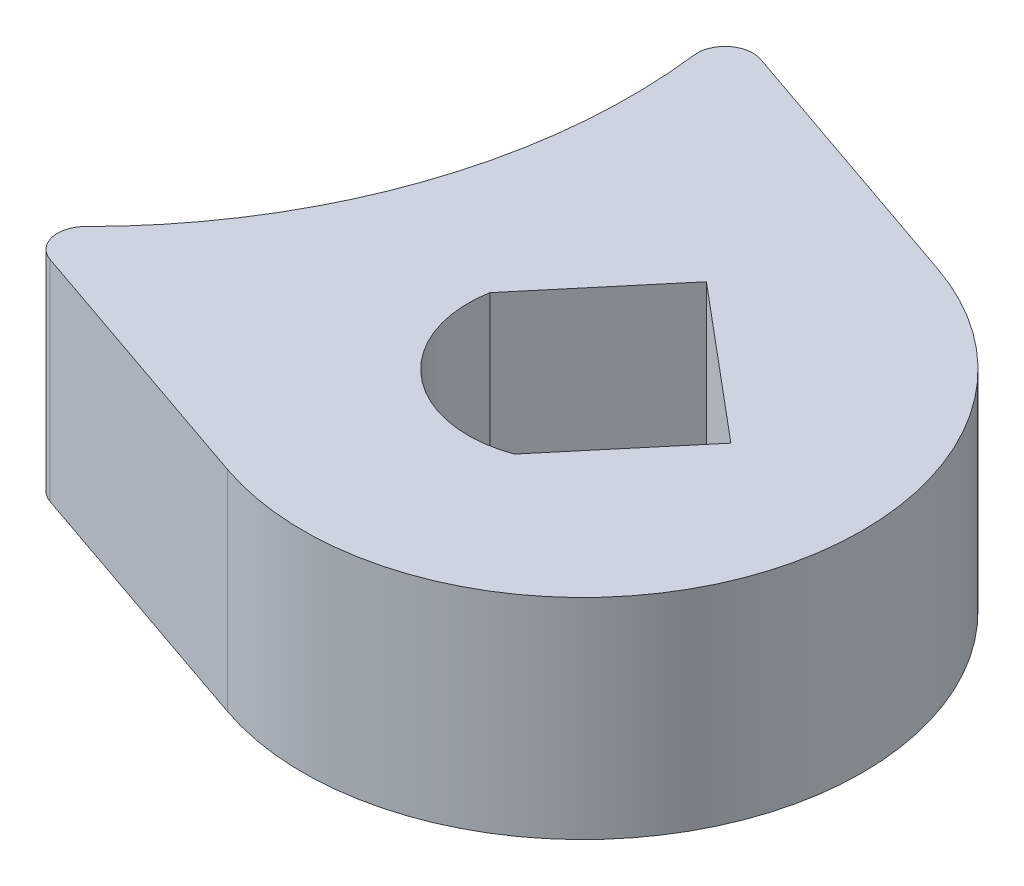
ISO-10303-21;
HEADER;
FILE_DESCRIPTION(('STEP AP214'),'2;1');
FILE_NAME('part.step','',(''),(''),'','','');
FILE_SCHEMA(('AUTOMOTIVE_DESIGN { 1 0 10303 214 1 1 1 1 }'));
ENDSEC;
DATA;
#1=APPLICATION_CONTEXT('core data for automotive mechanical design processes');
#2=APPLICATION_PROTOCOL_DEFINITION('international standard','automotive_design',2000,#1);
#3=PRODUCT_CONTEXT('',#1,'mechanical');
#4=PRODUCT('Part','Part','',(#3));
#5=PRODUCT_RELATED_PRODUCT_CATEGORY('part','',(#4));
#6=PRODUCT_DEFINITION_FORMATION('','',#4);
#7=PRODUCT_DEFINITION_CONTEXT('part definition',#1,'design');
#8=PRODUCT_DEFINITION('design','',#6,#7);
#9=PRODUCT_DEFINITION_SHAPE('','',#8);
#10=(LENGTH_UNIT() NAMED_UNIT(*) SI_UNIT(.MILLI.,.METRE.));
#11=(NAMED_UNIT(*) PLANE_ANGLE_UNIT() SI_UNIT($,.RADIAN.));
#12=(NAMED_UNIT(*) SI_UNIT($,.STERADIAN.) SOLID_ANGLE_UNIT());
#13=UNCERTAINTY_MEASURE_WITH_UNIT(LENGTH_MEASURE(1.E-05),#10,'distance_accuracy_value','');
#14=(GEOMETRIC_REPRESENTATION_CONTEXT(3) GLOBAL_UNCERTAINTY_ASSIGNED_CONTEXT((#13)) GLOBAL_UNIT_ASSIGNED_CONTEXT((#10,
#11,#12)) REPRESENTATION_CONTEXT('',''));
#15=CARTESIAN_POINT('',(0.,0.,0.));
#16=DIRECTION('',(0.,0.,1.));
#17=DIRECTION('',(1.,0.,0.));
#18=AXIS2_PLACEMENT_3D('',#15,#16,#17);
#19=CARTESIAN_POINT('',(0.,19.05,0.));
#20=DIRECTION('',(0.,1.,0.));
#21=DIRECTION('',(0.,0.,1.));
#22=AXIS2_PLACEMENT_3D('',#19,#20,#21);
#23=PLANE('',#22);
#24=CARTESIAN_POINT('',(-68.791514605057,19.05,-23.6828592581137));
#25=DIRECTION('',(0.,-1.,0.));
#26=DIRECTION('',(0.,0.,-1.));
#27=AXIS2_PLACEMENT_3D('',#24,#25,#26);
#28=CIRCLE('',#27,49.5);
#29=CARTESIAN_POINT('',(-19.6669026936804,19.05,-29.767471370371));
#30=VERTEX_POINT('',#29);
#31=CARTESIAN_POINT('',(-33.8232481986751,19.05,11.352413604136));
#32=VERTEX_POINT('',#31);
#33=EDGE_CURVE('E159',#30,#32,#28,.T.);
#34=ORIENTED_EDGE('',*,*,#33,.T.);
#35=CARTESIAN_POINT('',(-32.0289169527718,19.05,13.1501831611081));
#36=DIRECTION('',(0.,1.,0.));
#37=DIRECTION('',(0.,0.,1.));
#38=AXIS2_PLACEMENT_3D('',#35,#36,#37);
#39=CIRCLE('',#38,2.54);
#40=CARTESIAN_POINT('',(-32.8557365039277,19.05,15.5518428850961));
#41=VERTEX_POINT('',#40);
#42=EDGE_CURVE('E41',#32,#41,#39,.T.);
#43=ORIENTED_EDGE('',*,*,#42,.T.);
#44=DIRECTION('',(0.945535324404742,0.,0.325519508329102));
#45=VECTOR('',#44,1.);
#46=CARTESIAN_POINT('',(-36.8873646780203,19.05,14.1638739884052));
#47=LINE('',#46,#45);
#48=CARTESIAN_POINT('',(-8.26819551155919,19.05,24.0165972398804));
#49=VERTEX_POINT('',#48);
#50=EDGE_CURVE('E161',#41,#49,#47,.T.);
#51=ORIENTED_EDGE('',*,*,#50,.T.);
#52=CARTESIAN_POINT('',(0.,19.05,0.));
#53=DIRECTION('',(0.,1.,0.));
#54=DIRECTION('',(0.,0.,1.));
#55=AXIS2_PLACEMENT_3D('',#52,#53,#54);
#56=CIRCLE('',#55,25.4);
#57=CARTESIAN_POINT('',(8.2681955115592,19.05,-24.0165972398804));
#58=VERTEX_POINT('',#57);
#59=EDGE_CURVE('E153',#49,#58,#56,.T.);
#60=ORIENTED_EDGE('',*,*,#59,.T.);
#61=DIRECTION('',(-0.945535324404742,0.,-0.325519508329102));
#62=VECTOR('',#61,1.);
#63=CARTESIAN_POINT('',(8.2681955115592,19.05,-24.0165972398804));
#64=LINE('',#63,#62);
#65=CARTESIAN_POINT('',(-16.3193454808094,19.05,-32.4813515946648));
#66=VERTEX_POINT('',#65);
#67=EDGE_CURVE('E156',#58,#66,#64,.T.);
#68=ORIENTED_EDGE('',*,*,#67,.T.);
#69=CARTESIAN_POINT('',(-17.1461650319653,19.05,-30.0796918706767));
#70=DIRECTION('',(0.,1.,0.));
#71=DIRECTION('',(0.,0.,1.));
#72=AXIS2_PLACEMENT_3D('',#69,#70,#71);
#73=CIRCLE('',#72,2.54);
#74=EDGE_CURVE('E187',#66,#30,#73,.T.);
#75=ORIENTED_EDGE('',*,*,#74,.T.);
#76=EDGE_LOOP('',(#34,#43,#51,#60,#68,#75));
#77=FACE_BOUND('',#76,.T.);
#78=CARTESIAN_POINT('',(0.,19.05,0.));
#79=DIRECTION('',(0.,1.,0.));
#80=DIRECTION('',(0.,0.,1.));
#81=AXIS2_PLACEMENT_3D('',#78,#79,#80);
#82=CIRCLE('',#81,10.4109024390244);
#83=CARTESIAN_POINT('',(-10.2524267534263,19.05,-1.80959533059557));
#84=VERTEX_POINT('',#83);
#85=CARTESIAN_POINT('',(3.5624187337814,19.05,9.78243642249145));
#86=VERTEX_POINT('',#85);
#87=EDGE_CURVE('E122',#84,#86,#82,.T.);
#88=ORIENTED_EDGE('',*,*,#87,.F.);
#89=DIRECTION('',(-0.642787609686538,0.,0.766044443118979));
#90=VECTOR('',#89,1.);
#91=CARTESIAN_POINT('',(-10.2524267534263,19.05,-1.80959533059557));
#92=LINE('',#91,#90);
#93=CARTESIAN_POINT('',(-1.27268384610534,19.05,-12.5112362009677));
#94=VERTEX_POINT('',#93);
#95=EDGE_CURVE('E112',#94,#84,#92,.T.);
#96=ORIENTED_EDGE('',*,*,#95,.F.);
#97=DIRECTION('',(-0.766044443118979,0.,-0.642787609686538));
#98=VECTOR('',#97,1.);
#99=CARTESIAN_POINT('',(-1.27268384610534,19.05,-12.5112362009677));
#100=LINE('',#99,#98);
#101=CARTESIAN_POINT('',(12.5421616411023,19.05,-0.919204447880692));
#102=VERTEX_POINT('',#101);
#103=EDGE_CURVE('E137',#102,#94,#100,.T.);
#104=ORIENTED_EDGE('',*,*,#103,.F.);
#105=DIRECTION('',(0.642787609686538,0.,-0.766044443118979));
#106=VECTOR('',#105,1.);
#107=CARTESIAN_POINT('',(12.5421616411023,19.05,-0.919204447880689));
#108=LINE('',#107,#106);
#109=EDGE_CURVE('E135',#86,#102,#108,.T.);
#110=ORIENTED_EDGE('',*,*,#109,.F.);
#111=EDGE_LOOP('',(#88,#96,#104,#110));
#112=FACE_BOUND('',#111,.T.);
#113=ADVANCED_FACE('F33',(#77,#112),#23,.T.);
#114=CARTESIAN_POINT('',(0.,0.,0.));
#115=DIRECTION('',(0.,1.,0.));
#116=DIRECTION('',(0.,0.,1.));
#117=AXIS2_PLACEMENT_3D('',#114,#115,#116);
#118=PLANE('',#117);
#119=DIRECTION('',(0.945535324404742,0.,0.325519508329102));
#120=VECTOR('',#119,1.);
#121=CARTESIAN_POINT('',(-36.8873646780203,0.,14.1638739884052));
#122=LINE('',#121,#120);
#123=CARTESIAN_POINT('',(-32.8557365039277,0.,15.5518428850961));
#124=VERTEX_POINT('',#123);
#125=CARTESIAN_POINT('',(-8.26819551155919,0.,24.0165972398804));
#126=VERTEX_POINT('',#125);
#127=EDGE_CURVE('E157',#124,#126,#122,.T.);
#128=ORIENTED_EDGE('',*,*,#127,.F.);
#129=CARTESIAN_POINT('',(-32.0289169527718,0.,13.1501831611081));
#130=DIRECTION('',(0.,1.,0.));
#131=DIRECTION('',(0.,0.,1.));
#132=AXIS2_PLACEMENT_3D('',#129,#130,#131);
#133=CIRCLE('',#132,2.54);
#134=CARTESIAN_POINT('',(-33.8232481986751,0.,11.352413604136));
#135=VERTEX_POINT('',#134);
#136=EDGE_CURVE('E181',#124,#135,#133,.F.);
#137=ORIENTED_EDGE('',*,*,#136,.T.);
#138=CARTESIAN_POINT('',(-68.791514605057,0.,-23.6828592581137));
#139=DIRECTION('',(0.,-1.,0.));
#140=DIRECTION('',(0.,0.,-1.));
#141=AXIS2_PLACEMENT_3D('',#138,#139,#140);
#142=CIRCLE('',#141,49.5);
#143=CARTESIAN_POINT('',(-19.6669026936804,0.,-29.767471370371));
#144=VERTEX_POINT('',#143);
#145=EDGE_CURVE('E168',#144,#135,#142,.T.);
#146=ORIENTED_EDGE('',*,*,#145,.F.);
#147=CARTESIAN_POINT('',(-17.1461650319653,0.,-30.0796918706767));
#148=DIRECTION('',(0.,1.,0.));
#149=DIRECTION('',(0.,0.,1.));
#150=AXIS2_PLACEMENT_3D('',#147,#148,#149);
#151=CIRCLE('',#150,2.54);
#152=CARTESIAN_POINT('',(-16.3193454808094,0.,-32.4813515946648));
#153=VERTEX_POINT('',#152);
#154=EDGE_CURVE('E179',#144,#153,#151,.F.);
#155=ORIENTED_EDGE('',*,*,#154,.T.);
#156=DIRECTION('',(-0.945535324404742,0.,-0.325519508329102));
#157=VECTOR('',#156,1.);
#158=CARTESIAN_POINT('',(8.2681955115592,0.,-24.0165972398804));
#159=LINE('',#158,#157);
#160=CARTESIAN_POINT('',(8.2681955115592,0.,-24.0165972398804));
#161=VERTEX_POINT('',#160);
#162=EDGE_CURVE('E166',#161,#153,#159,.T.);
#163=ORIENTED_EDGE('',*,*,#162,.F.);
#164=CARTESIAN_POINT('',(0.,0.,0.));
#165=DIRECTION('',(0.,1.,0.));
#166=DIRECTION('',(0.,0.,1.));
#167=AXIS2_PLACEMENT_3D('',#164,#165,#166);
#168=CIRCLE('',#167,25.4);
#169=EDGE_CURVE('E130',#126,#161,#168,.T.);
#170=ORIENTED_EDGE('',*,*,#169,.F.);
#171=EDGE_LOOP('',(#128,#137,#146,#155,#163,#170));
#172=FACE_BOUND('',#171,.T.);
#173=DIRECTION('',(-0.642787609686538,0.,0.766044443118979));
#174=VECTOR('',#173,1.);
#175=CARTESIAN_POINT('',(-10.2524267534263,0.,-1.80959533059557));
#176=LINE('',#175,#174);
#177=CARTESIAN_POINT('',(-1.27268384610534,0.,-12.5112362009677));
#178=VERTEX_POINT('',#177);
#179=CARTESIAN_POINT('',(-10.2524267534263,0.,-1.80959533059557));
#180=VERTEX_POINT('',#179);
#181=EDGE_CURVE('E141',#178,#180,#176,.T.);
#182=ORIENTED_EDGE('',*,*,#181,.T.);
#183=CARTESIAN_POINT('',(0.,0.,0.));
#184=DIRECTION('',(0.,1.,0.));
#185=DIRECTION('',(0.,0.,1.));
#186=AXIS2_PLACEMENT_3D('',#183,#184,#185);
#187=CIRCLE('',#186,10.4109024390244);
#188=CARTESIAN_POINT('',(3.5624187337814,0.,9.78243642249145));
#189=VERTEX_POINT('',#188);
#190=EDGE_CURVE('E129',#180,#189,#187,.T.);
#191=ORIENTED_EDGE('',*,*,#190,.T.);
#192=DIRECTION('',(0.642787609686538,0.,-0.766044443118979));
#193=VECTOR('',#192,1.);
#194=CARTESIAN_POINT('',(12.5421616411023,0.,-0.919204447880689));
#195=LINE('',#194,#193);
#196=CARTESIAN_POINT('',(12.5421616411023,0.,-0.919204447880689));
#197=VERTEX_POINT('',#196);
#198=EDGE_CURVE('E144',#189,#197,#195,.T.);
#199=ORIENTED_EDGE('',*,*,#198,.T.);
#200=DIRECTION('',(-0.766044443118979,0.,-0.642787609686538));
#201=VECTOR('',#200,1.);
#202=CARTESIAN_POINT('',(-1.27268384610534,0.,-12.5112362009677));
#203=LINE('',#202,#201);
#204=EDGE_CURVE('E123',#197,#178,#203,.T.);
#205=ORIENTED_EDGE('',*,*,#204,.T.);
#206=EDGE_LOOP('',(#182,#191,#199,#205));
#207=FACE_BOUND('',#206,.T.);
#208=ADVANCED_FACE('F201',(#172,#207),#118,.F.);
#209=CARTESIAN_POINT('',(0.,19.05,0.));
#210=DIRECTION('',(0.,-1.,0.));
#211=DIRECTION('',(0.,0.,-1.));
#212=AXIS2_PLACEMENT_3D('',#209,#210,#211);
#213=CYLINDRICAL_SURFACE('',#212,25.4);
#214=ORIENTED_EDGE('',*,*,#169,.T.);
#215=DIRECTION('',(0.,-1.,0.));
#216=VECTOR('',#215,1.);
#217=CARTESIAN_POINT('',(8.2681955115592,19.05,-24.0165972398804));
#218=LINE('',#217,#216);
#219=EDGE_CURVE('E173',#58,#161,#218,.T.);
#220=ORIENTED_EDGE('',*,*,#219,.F.);
#221=ORIENTED_EDGE('',*,*,#59,.F.);
#222=DIRECTION('',(0.,-1.,0.));
#223=VECTOR('',#222,1.);
#224=CARTESIAN_POINT('',(-8.26819551155919,19.05,24.0165972398804));
#225=LINE('',#224,#223);
#226=EDGE_CURVE('E163',#49,#126,#225,.T.);
#227=ORIENTED_EDGE('',*,*,#226,.T.);
#228=EDGE_LOOP('',(#214,#220,#221,#227));
#229=FACE_BOUND('',#228,.T.);
#230=ADVANCED_FACE('F211',(#229),#213,.T.);
#231=CARTESIAN_POINT('',(8.2681955115592,19.05,-24.0165972398804));
#232=DIRECTION('',(-0.325519508329102,0.,0.945535324404742));
#233=DIRECTION('',(0.945535324404742,0.,0.325519508329102));
#234=AXIS2_PLACEMENT_3D('',#231,#232,#233);
#235=PLANE('',#234);
#236=ORIENTED_EDGE('',*,*,#162,.T.);
#237=DIRECTION('',(0.,-1.,0.));
#238=VECTOR('',#237,1.);
#239=CARTESIAN_POINT('',(-16.3193454808094,19.05,-32.4813515946648));
#240=LINE('',#239,#238);
#241=EDGE_CURVE('E11',#153,#66,#240,.F.);
#242=ORIENTED_EDGE('',*,*,#241,.T.);
#243=ORIENTED_EDGE('',*,*,#67,.F.);
#244=ORIENTED_EDGE('',*,*,#219,.T.);
#245=EDGE_LOOP('',(#236,#242,#243,#244));
#246=FACE_BOUND('',#245,.T.);
#247=ADVANCED_FACE('F208',(#246),#235,.F.);
#248=CARTESIAN_POINT('',(-68.791514605057,19.05,-23.6828592581137));
#249=DIRECTION('',(0.,-1.,0.));
#250=DIRECTION('',(0.,0.,-1.));
#251=AXIS2_PLACEMENT_3D('',#248,#249,#250);
#252=CYLINDRICAL_SURFACE('',#251,49.5);
#253=ORIENTED_EDGE('',*,*,#145,.T.);
#254=DIRECTION('',(0.,-1.,0.));
#255=VECTOR('',#254,1.);
#256=CARTESIAN_POINT('',(-33.8232481986751,19.05,11.352413604136));
#257=LINE('',#256,#255);
#258=EDGE_CURVE('E54',#135,#32,#257,.F.);
#259=ORIENTED_EDGE('',*,*,#258,.T.);
#260=ORIENTED_EDGE('',*,*,#33,.F.);
#261=DIRECTION('',(0.,-1.,0.));
#262=VECTOR('',#261,1.);
#263=CARTESIAN_POINT('',(-19.6669026936804,19.05,-29.767471370371));
#264=LINE('',#263,#262);
#265=EDGE_CURVE('E183',#30,#144,#264,.T.);
#266=ORIENTED_EDGE('',*,*,#265,.T.);
#267=EDGE_LOOP('',(#253,#259,#260,#266));
#268=FACE_BOUND('',#267,.T.);
#269=ADVANCED_FACE('F204',(#268),#252,.F.);
#270=CARTESIAN_POINT('',(-36.8873646780203,19.05,14.1638739884052));
#271=DIRECTION('',(0.325519508329102,0.,-0.945535324404741));
#272=DIRECTION('',(-0.945535324404742,0.,-0.325519508329102));
#273=AXIS2_PLACEMENT_3D('',#270,#271,#272);
#274=PLANE('',#273);
#275=ORIENTED_EDGE('',*,*,#50,.F.);
#276=DIRECTION('',(0.,-1.,0.));
#277=VECTOR('',#276,1.);
#278=CARTESIAN_POINT('',(-32.8557365039277,19.05,15.5518428850961));
#279=LINE('',#278,#277);
#280=EDGE_CURVE('E176',#41,#124,#279,.T.);
#281=ORIENTED_EDGE('',*,*,#280,.T.);
#282=ORIENTED_EDGE('',*,*,#127,.T.);
#283=ORIENTED_EDGE('',*,*,#226,.F.);
#284=EDGE_LOOP('',(#275,#281,#282,#283));
#285=FACE_BOUND('',#284,.T.);
#286=ADVANCED_FACE('F195',(#285),#274,.F.);
#287=CARTESIAN_POINT('',(-10.2524267534263,19.05,-1.80959533059557));
#288=DIRECTION('',(0.766044443118979,0.,0.642787609686538));
#289=DIRECTION('',(0.642787609686538,0.,-0.766044443118979));
#290=AXIS2_PLACEMENT_3D('',#287,#288,#289);
#291=PLANE('',#290);
#292=ORIENTED_EDGE('',*,*,#181,.F.);
#293=DIRECTION('',(0.,-1.,0.));
#294=VECTOR('',#293,1.);
#295=CARTESIAN_POINT('',(-1.27268384610534,19.05,-12.5112362009677));
#296=LINE('',#295,#294);
#297=EDGE_CURVE('E118',#94,#178,#296,.T.);
#298=ORIENTED_EDGE('',*,*,#297,.F.);
#299=ORIENTED_EDGE('',*,*,#95,.T.);
#300=DIRECTION('',(0.,-1.,0.));
#301=VECTOR('',#300,1.);
#302=CARTESIAN_POINT('',(-10.2524267534263,19.05,-1.80959533059557));
#303=LINE('',#302,#301);
#304=EDGE_CURVE('E115',#84,#180,#303,.T.);
#305=ORIENTED_EDGE('',*,*,#304,.T.);
#306=EDGE_LOOP('',(#292,#298,#299,#305));
#307=FACE_BOUND('',#306,.T.);
#308=ADVANCED_FACE('F114',(#307),#291,.T.);
#309=CARTESIAN_POINT('',(0.,19.05,0.));
#310=DIRECTION('',(0.,-1.,0.));
#311=DIRECTION('',(0.,0.,-1.));
#312=AXIS2_PLACEMENT_3D('',#309,#310,#311);
#313=CYLINDRICAL_SURFACE('',#312,10.4109024390244);
#314=ORIENTED_EDGE('',*,*,#190,.F.);
#315=ORIENTED_EDGE('',*,*,#304,.F.);
#316=ORIENTED_EDGE('',*,*,#87,.T.);
#317=DIRECTION('',(0.,-1.,0.));
#318=VECTOR('',#317,1.);
#319=CARTESIAN_POINT('',(3.5624187337814,19.05,9.78243642249145));
#320=LINE('',#319,#318);
#321=EDGE_CURVE('E131',#86,#189,#320,.T.);
#322=ORIENTED_EDGE('',*,*,#321,.T.);
#323=EDGE_LOOP('',(#314,#315,#316,#322));
#324=FACE_BOUND('',#323,.T.);
#325=ADVANCED_FACE('F126',(#324),#313,.F.);
#326=CARTESIAN_POINT('',(12.5421616411023,19.05,-0.919204447880689));
#327=DIRECTION('',(-0.766044443118979,0.,-0.642787609686538));
#328=DIRECTION('',(-0.642787609686538,0.,0.766044443118979));
#329=AXIS2_PLACEMENT_3D('',#326,#327,#328);
#330=PLANE('',#329);
#331=ORIENTED_EDGE('',*,*,#198,.F.);
#332=ORIENTED_EDGE('',*,*,#321,.F.);
#333=ORIENTED_EDGE('',*,*,#109,.T.);
#334=DIRECTION('',(0.,-1.,0.));
#335=VECTOR('',#334,1.);
#336=CARTESIAN_POINT('',(12.5421616411023,19.05,-0.919204447880689));
#337=LINE('',#336,#335);
#338=EDGE_CURVE('E150',#102,#197,#337,.T.);
#339=ORIENTED_EDGE('',*,*,#338,.T.);
#340=EDGE_LOOP('',(#331,#332,#333,#339));
#341=FACE_BOUND('',#340,.T.);
#342=ADVANCED_FACE('F250',(#341),#330,.T.);
#343=CARTESIAN_POINT('',(-1.27268384610534,19.05,-12.5112362009677));
#344=DIRECTION('',(-0.642787609686538,0.,0.766044443118979));
#345=DIRECTION('',(0.766044443118979,0.,0.642787609686538));
#346=AXIS2_PLACEMENT_3D('',#343,#344,#345);
#347=PLANE('',#346);
#348=ORIENTED_EDGE('',*,*,#204,.F.);
#349=ORIENTED_EDGE('',*,*,#338,.F.);
#350=ORIENTED_EDGE('',*,*,#103,.T.);
#351=ORIENTED_EDGE('',*,*,#297,.T.);
#352=EDGE_LOOP('',(#348,#349,#350,#351));
#353=FACE_BOUND('',#352,.T.);
#354=ADVANCED_FACE('F256',(#353),#347,.T.);
#355=CARTESIAN_POINT('',(-32.0289169527718,19.05,13.1501831611081));
#356=DIRECTION('',(0.,-1.,0.));
#357=DIRECTION('',(0.,0.,-1.));
#358=AXIS2_PLACEMENT_3D('',#355,#356,#357);
#359=CYLINDRICAL_SURFACE('',#358,2.54);
#360=ORIENTED_EDGE('',*,*,#42,.F.);
#361=ORIENTED_EDGE('',*,*,#258,.F.);
#362=ORIENTED_EDGE('',*,*,#136,.F.);
#363=ORIENTED_EDGE('',*,*,#280,.F.);
#364=EDGE_LOOP('',(#360,#361,#362,#363));
#365=FACE_BOUND('',#364,.T.);
#366=ADVANCED_FACE('F198',(#365),#359,.T.);
#367=CARTESIAN_POINT('',(-17.1461650319653,19.05,-30.0796918706767));
#368=DIRECTION('',(0.,-1.,0.));
#369=DIRECTION('',(0.,0.,-1.));
#370=AXIS2_PLACEMENT_3D('',#367,#368,#369);
#371=CYLINDRICAL_SURFACE('',#370,2.54);
#372=ORIENTED_EDGE('',*,*,#74,.F.);
#373=ORIENTED_EDGE('',*,*,#241,.F.);
#374=ORIENTED_EDGE('',*,*,#154,.F.);
#375=ORIENTED_EDGE('',*,*,#265,.F.);
#376=EDGE_LOOP('',(#372,#373,#374,#375));
#377=FACE_BOUND('',#376,.T.);
#378=ADVANCED_FACE('F35',(#377),#371,.T.);
#379=CLOSED_SHELL('',(#113,#208,#230,#247,#269,#286,#308,#325,#342,#354,#366,#378));
#380=MANIFOLD_SOLID_BREP('B2',#379);
#381=ADVANCED_BREP_SHAPE_REPRESENTATION('',(#18,#380),#14);
#382=SHAPE_DEFINITION_REPRESENTATION(#9,#381);
ENDSEC;
END-ISO-10303-21;
